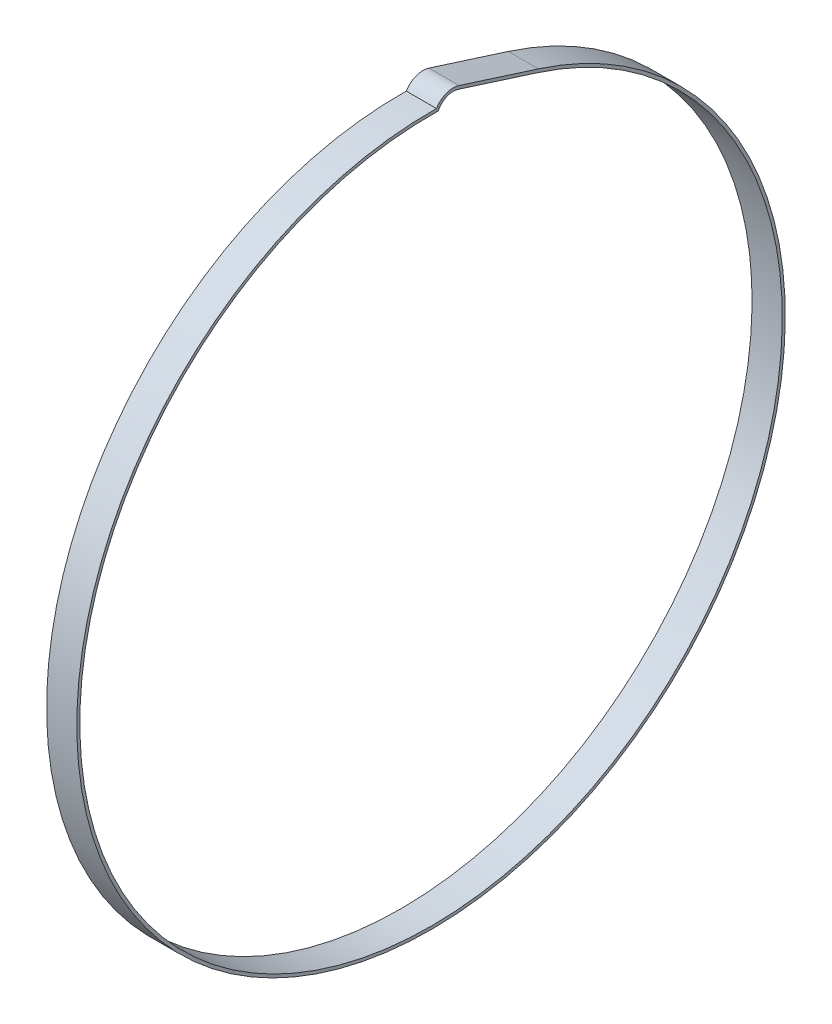
ISO-10303-21;
HEADER;
FILE_DESCRIPTION(('STEP AP214'),'2;1');
FILE_NAME('part.step','',(''),(''),'','','');
FILE_SCHEMA(('AUTOMOTIVE_DESIGN { 1 0 10303 214 1 1 1 1 }'));
ENDSEC;
DATA;
#1=APPLICATION_CONTEXT('core data for automotive mechanical design processes');
#2=APPLICATION_PROTOCOL_DEFINITION('international standard','automotive_design',2000,#1);
#3=PRODUCT_CONTEXT('',#1,'mechanical');
#4=PRODUCT('Part','Part','',(#3));
#5=PRODUCT_RELATED_PRODUCT_CATEGORY('part','',(#4));
#6=PRODUCT_DEFINITION_FORMATION('','',#4);
#7=PRODUCT_DEFINITION_CONTEXT('part definition',#1,'design');
#8=PRODUCT_DEFINITION('design','',#6,#7);
#9=PRODUCT_DEFINITION_SHAPE('','',#8);
#10=(LENGTH_UNIT() NAMED_UNIT(*) SI_UNIT(.MILLI.,.METRE.));
#11=(NAMED_UNIT(*) PLANE_ANGLE_UNIT() SI_UNIT($,.RADIAN.));
#12=(NAMED_UNIT(*) SI_UNIT($,.STERADIAN.) SOLID_ANGLE_UNIT());
#13=UNCERTAINTY_MEASURE_WITH_UNIT(LENGTH_MEASURE(1.E-05),#10,'distance_accuracy_value','');
#14=(GEOMETRIC_REPRESENTATION_CONTEXT(3) GLOBAL_UNCERTAINTY_ASSIGNED_CONTEXT((#13)) GLOBAL_UNIT_ASSIGNED_CONTEXT((#10,
#11,#12)) REPRESENTATION_CONTEXT('',''));
#15=CARTESIAN_POINT('',(0.,0.,0.));
#16=DIRECTION('',(0.,0.,1.));
#17=DIRECTION('',(1.,0.,0.));
#18=AXIS2_PLACEMENT_3D('',#15,#16,#17);
#19=CARTESIAN_POINT('',(12.7,144.783556825344,-9.316863342459));
#20=DIRECTION('',(1.,0.,0.));
#21=DIRECTION('',(0.,0.,-1.));
#22=AXIS2_PLACEMENT_3D('',#19,#20,#21);
#23=PLANE('',#22);
#24=CARTESIAN_POINT('',(12.7,144.783556825344,-9.316863342459));
#25=DIRECTION('',(1.,0.,0.));
#26=DIRECTION('',(0.,0.,-1.));
#27=AXIS2_PLACEMENT_3D('',#24,#25,#26);
#28=CIRCLE('',#27,8.17909252443305);
#29=CARTESIAN_POINT('',(12.7,152.57755531297,-11.7970129545034));
#30=VERTEX_POINT('',#29);
#31=CARTESIAN_POINT('',(12.7,148.953541859624,-2.28061581006538));
#32=VERTEX_POINT('',#31);
#33=EDGE_CURVE('E131',#30,#32,#28,.T.);
#34=ORIENTED_EDGE('',*,*,#33,.T.);
#35=CARTESIAN_POINT('',(12.7,0.,0.));
#36=DIRECTION('',(1.,0.,0.));
#37=DIRECTION('',(0.,0.,-1.));
#38=AXIS2_PLACEMENT_3D('',#35,#36,#37);
#39=CIRCLE('',#38,148.971);
#40=CARTESIAN_POINT('',(12.7,141.95703804935,-45.1725379988269));
#41=VERTEX_POINT('',#40);
#42=EDGE_CURVE('E135',#32,#41,#39,.T.);
#43=ORIENTED_EDGE('',*,*,#42,.T.);
#44=DIRECTION('',(0.,0.303230413965314,0.952917266107832));
#45=VECTOR('',#44,1.);
#46=CARTESIAN_POINT('',(12.7,141.95703804935,-45.172537998827));
#47=LINE('',#46,#45);
#48=EDGE_CURVE('E139',#41,#30,#47,.T.);
#49=ORIENTED_EDGE('',*,*,#48,.T.);
#50=EDGE_LOOP('',(#34,#43,#49));
#51=FACE_BOUND('',#50,.T.);
#52=DIRECTION('',(0.,0.303230413965313,0.952917266107832));
#53=VECTOR('',#52,1.);
#54=CARTESIAN_POINT('',(12.7,140.746833121393,-44.787435373091));
#55=LINE('',#54,#53);
#56=CARTESIAN_POINT('',(12.7,140.746833121393,-44.787435373091));
#57=VERTEX_POINT('',#56);
#58=CARTESIAN_POINT('',(12.7,151.367350385013,-11.4119103287675));
#59=VERTEX_POINT('',#58);
#60=EDGE_CURVE('E104',#57,#59,#55,.T.);
#61=ORIENTED_EDGE('',*,*,#60,.F.);
#62=CARTESIAN_POINT('',(12.7,0.,0.));
#63=DIRECTION('',(1.,0.,0.));
#64=DIRECTION('',(0.,0.,-1.));
#65=AXIS2_PLACEMENT_3D('',#62,#63,#64);
#66=CIRCLE('',#65,147.701);
#67=CARTESIAN_POINT('',(12.7,147.669722670583,-3.03947485480343));
#68=VERTEX_POINT('',#67);
#69=EDGE_CURVE('E95',#68,#57,#66,.T.);
#70=ORIENTED_EDGE('',*,*,#69,.F.);
#71=CARTESIAN_POINT('',(12.7,144.783556825344,-9.316863342459));
#72=DIRECTION('',(1.,0.,0.));
#73=DIRECTION('',(0.,0.,-1.));
#74=AXIS2_PLACEMENT_3D('',#71,#72,#73);
#75=CIRCLE('',#74,6.90909252443304);
#76=EDGE_CURVE('E114',#59,#68,#75,.T.);
#77=ORIENTED_EDGE('',*,*,#76,.F.);
#78=EDGE_LOOP('',(#61,#70,#77));
#79=FACE_BOUND('',#78,.T.);
#80=ADVANCED_FACE('F41',(#51,#79),#23,.T.);
#81=CARTESIAN_POINT('',(0.,144.783556825344,-9.316863342459));
#82=DIRECTION('',(1.,0.,0.));
#83=DIRECTION('',(0.,0.,-1.));
#84=AXIS2_PLACEMENT_3D('',#81,#82,#83);
#85=PLANE('',#84);
#86=CARTESIAN_POINT('',(0.,144.783556825344,-9.316863342459));
#87=DIRECTION('',(1.,0.,0.));
#88=DIRECTION('',(0.,0.,-1.));
#89=AXIS2_PLACEMENT_3D('',#86,#87,#88);
#90=CIRCLE('',#89,8.17909252443305);
#91=CARTESIAN_POINT('',(0.,152.57755531297,-11.7970129545034));
#92=VERTEX_POINT('',#91);
#93=CARTESIAN_POINT('',(0.,148.953541859624,-2.28061581006538));
#94=VERTEX_POINT('',#93);
#95=EDGE_CURVE('E112',#92,#94,#90,.T.);
#96=ORIENTED_EDGE('',*,*,#95,.F.);
#97=DIRECTION('',(0.,0.303230413965314,0.952917266107832));
#98=VECTOR('',#97,1.);
#99=CARTESIAN_POINT('',(0.,141.95703804935,-45.172537998827));
#100=LINE('',#99,#98);
#101=CARTESIAN_POINT('',(0.,141.95703804935,-45.1725379988269));
#102=VERTEX_POINT('',#101);
#103=EDGE_CURVE('E136',#102,#92,#100,.T.);
#104=ORIENTED_EDGE('',*,*,#103,.F.);
#105=CARTESIAN_POINT('',(0.,0.,0.));
#106=DIRECTION('',(1.,0.,0.));
#107=DIRECTION('',(0.,0.,-1.));
#108=AXIS2_PLACEMENT_3D('',#105,#106,#107);
#109=CIRCLE('',#108,148.971);
#110=EDGE_CURVE('E146',#94,#102,#109,.T.);
#111=ORIENTED_EDGE('',*,*,#110,.F.);
#112=EDGE_LOOP('',(#96,#104,#111));
#113=FACE_BOUND('',#112,.T.);
#114=CARTESIAN_POINT('',(0.,0.,0.));
#115=DIRECTION('',(1.,0.,0.));
#116=DIRECTION('',(0.,0.,-1.));
#117=AXIS2_PLACEMENT_3D('',#114,#115,#116);
#118=CIRCLE('',#117,147.701);
#119=CARTESIAN_POINT('',(0.,147.669722670583,-3.03947485480343));
#120=VERTEX_POINT('',#119);
#121=CARTESIAN_POINT('',(0.,140.746833121393,-44.787435373091));
#122=VERTEX_POINT('',#121);
#123=EDGE_CURVE('E65',#120,#122,#118,.T.);
#124=ORIENTED_EDGE('',*,*,#123,.T.);
#125=DIRECTION('',(0.,0.303230413965313,0.952917266107832));
#126=VECTOR('',#125,1.);
#127=CARTESIAN_POINT('',(0.,140.746833121393,-44.787435373091));
#128=LINE('',#127,#126);
#129=CARTESIAN_POINT('',(0.,151.367350385013,-11.4119103287675));
#130=VERTEX_POINT('',#129);
#131=EDGE_CURVE('E110',#122,#130,#128,.T.);
#132=ORIENTED_EDGE('',*,*,#131,.T.);
#133=CARTESIAN_POINT('',(0.,144.783556825344,-9.316863342459));
#134=DIRECTION('',(1.,0.,0.));
#135=DIRECTION('',(0.,0.,-1.));
#136=AXIS2_PLACEMENT_3D('',#133,#134,#135);
#137=CIRCLE('',#136,6.90909252443304);
#138=EDGE_CURVE('E105',#130,#120,#137,.T.);
#139=ORIENTED_EDGE('',*,*,#138,.T.);
#140=EDGE_LOOP('',(#124,#132,#139));
#141=FACE_BOUND('',#140,.T.);
#142=ADVANCED_FACE('F164',(#113,#141),#85,.F.);
#143=CARTESIAN_POINT('',(12.7,144.783556825344,-9.316863342459));
#144=DIRECTION('',(-1.,0.,0.));
#145=DIRECTION('',(0.,0.,1.));
#146=AXIS2_PLACEMENT_3D('',#143,#144,#145);
#147=CYLINDRICAL_SURFACE('',#146,8.17909252443305);
#148=ORIENTED_EDGE('',*,*,#95,.T.);
#149=DIRECTION('',(-1.,0.,0.));
#150=VECTOR('',#149,1.);
#151=CARTESIAN_POINT('',(12.7,148.953541859624,-2.28061581006538));
#152=LINE('',#151,#150);
#153=EDGE_CURVE('E11',#32,#94,#152,.T.);
#154=ORIENTED_EDGE('',*,*,#153,.F.);
#155=ORIENTED_EDGE('',*,*,#33,.F.);
#156=DIRECTION('',(-1.,0.,0.));
#157=VECTOR('',#156,1.);
#158=CARTESIAN_POINT('',(12.7,152.57755531297,-11.7970129545034));
#159=LINE('',#158,#157);
#160=EDGE_CURVE('E142',#30,#92,#159,.T.);
#161=ORIENTED_EDGE('',*,*,#160,.T.);
#162=EDGE_LOOP('',(#148,#154,#155,#161));
#163=FACE_BOUND('',#162,.T.);
#164=ADVANCED_FACE('F43',(#163),#147,.T.);
#165=CARTESIAN_POINT('',(12.7,0.,0.));
#166=DIRECTION('',(-1.,0.,0.));
#167=DIRECTION('',(0.,0.,1.));
#168=AXIS2_PLACEMENT_3D('',#165,#166,#167);
#169=CYLINDRICAL_SURFACE('',#168,148.971);
#170=ORIENTED_EDGE('',*,*,#110,.T.);
#171=DIRECTION('',(-1.,0.,0.));
#172=VECTOR('',#171,1.);
#173=CARTESIAN_POINT('',(12.7,141.95703804935,-45.1725379988269));
#174=LINE('',#173,#172);
#175=EDGE_CURVE('E50',#41,#102,#174,.T.);
#176=ORIENTED_EDGE('',*,*,#175,.F.);
#177=ORIENTED_EDGE('',*,*,#42,.F.);
#178=ORIENTED_EDGE('',*,*,#153,.T.);
#179=EDGE_LOOP('',(#170,#176,#177,#178));
#180=FACE_BOUND('',#179,.T.);
#181=ADVANCED_FACE('F170',(#180),#169,.T.);
#182=CARTESIAN_POINT('',(12.7,141.95703804935,-45.172537998827));
#183=DIRECTION('',(0.,-0.952917266107832,0.303230413965314));
#184=DIRECTION('',(0.,-0.303230413965314,-0.952917266107832));
#185=AXIS2_PLACEMENT_3D('',#182,#183,#184);
#186=PLANE('',#185);
#187=ORIENTED_EDGE('',*,*,#103,.T.);
#188=ORIENTED_EDGE('',*,*,#160,.F.);
#189=ORIENTED_EDGE('',*,*,#48,.F.);
#190=ORIENTED_EDGE('',*,*,#175,.T.);
#191=EDGE_LOOP('',(#187,#188,#189,#190));
#192=FACE_BOUND('',#191,.T.);
#193=ADVANCED_FACE('F159',(#192),#186,.F.);
#194=CARTESIAN_POINT('',(12.7,0.,0.));
#195=DIRECTION('',(-1.,0.,0.));
#196=DIRECTION('',(0.,0.,1.));
#197=AXIS2_PLACEMENT_3D('',#194,#195,#196);
#198=CYLINDRICAL_SURFACE('',#197,147.701);
#199=ORIENTED_EDGE('',*,*,#123,.F.);
#200=DIRECTION('',(-1.,0.,0.));
#201=VECTOR('',#200,1.);
#202=CARTESIAN_POINT('',(12.7,147.669722670583,-3.03947485480343));
#203=LINE('',#202,#201);
#204=EDGE_CURVE('E99',#68,#120,#203,.T.);
#205=ORIENTED_EDGE('',*,*,#204,.F.);
#206=ORIENTED_EDGE('',*,*,#69,.T.);
#207=DIRECTION('',(-1.,0.,0.));
#208=VECTOR('',#207,1.);
#209=CARTESIAN_POINT('',(12.7,140.746833121393,-44.787435373091));
#210=LINE('',#209,#208);
#211=EDGE_CURVE('E98',#57,#122,#210,.T.);
#212=ORIENTED_EDGE('',*,*,#211,.T.);
#213=EDGE_LOOP('',(#199,#205,#206,#212));
#214=FACE_BOUND('',#213,.T.);
#215=ADVANCED_FACE('F97',(#214),#198,.F.);
#216=CARTESIAN_POINT('',(12.7,140.746833121393,-44.787435373091));
#217=DIRECTION('',(0.,-0.952917266107832,0.303230413965313));
#218=DIRECTION('',(0.,-0.303230413965313,-0.952917266107832));
#219=AXIS2_PLACEMENT_3D('',#216,#217,#218);
#220=PLANE('',#219);
#221=ORIENTED_EDGE('',*,*,#131,.F.);
#222=ORIENTED_EDGE('',*,*,#211,.F.);
#223=ORIENTED_EDGE('',*,*,#60,.T.);
#224=DIRECTION('',(-1.,0.,0.));
#225=VECTOR('',#224,1.);
#226=CARTESIAN_POINT('',(12.7,151.367350385013,-11.4119103287675));
#227=LINE('',#226,#225);
#228=EDGE_CURVE('E57',#59,#130,#227,.T.);
#229=ORIENTED_EDGE('',*,*,#228,.T.);
#230=EDGE_LOOP('',(#221,#222,#223,#229));
#231=FACE_BOUND('',#230,.T.);
#232=ADVANCED_FACE('F108',(#231),#220,.T.);
#233=CARTESIAN_POINT('',(12.7,144.783556825344,-9.316863342459));
#234=DIRECTION('',(-1.,0.,0.));
#235=DIRECTION('',(0.,0.,1.));
#236=AXIS2_PLACEMENT_3D('',#233,#234,#235);
#237=CYLINDRICAL_SURFACE('',#236,6.90909252443304);
#238=ORIENTED_EDGE('',*,*,#138,.F.);
#239=ORIENTED_EDGE('',*,*,#228,.F.);
#240=ORIENTED_EDGE('',*,*,#76,.T.);
#241=ORIENTED_EDGE('',*,*,#204,.T.);
#242=EDGE_LOOP('',(#238,#239,#240,#241));
#243=FACE_BOUND('',#242,.T.);
#244=ADVANCED_FACE('F188',(#243),#237,.F.);
#245=CLOSED_SHELL('',(#80,#142,#164,#181,#193,#215,#232,#244));
#246=MANIFOLD_SOLID_BREP('B2',#245);
#247=ADVANCED_BREP_SHAPE_REPRESENTATION('',(#18,#246),#14);
#248=SHAPE_DEFINITION_REPRESENTATION(#9,#247);
ENDSEC;
END-ISO-10303-21;
